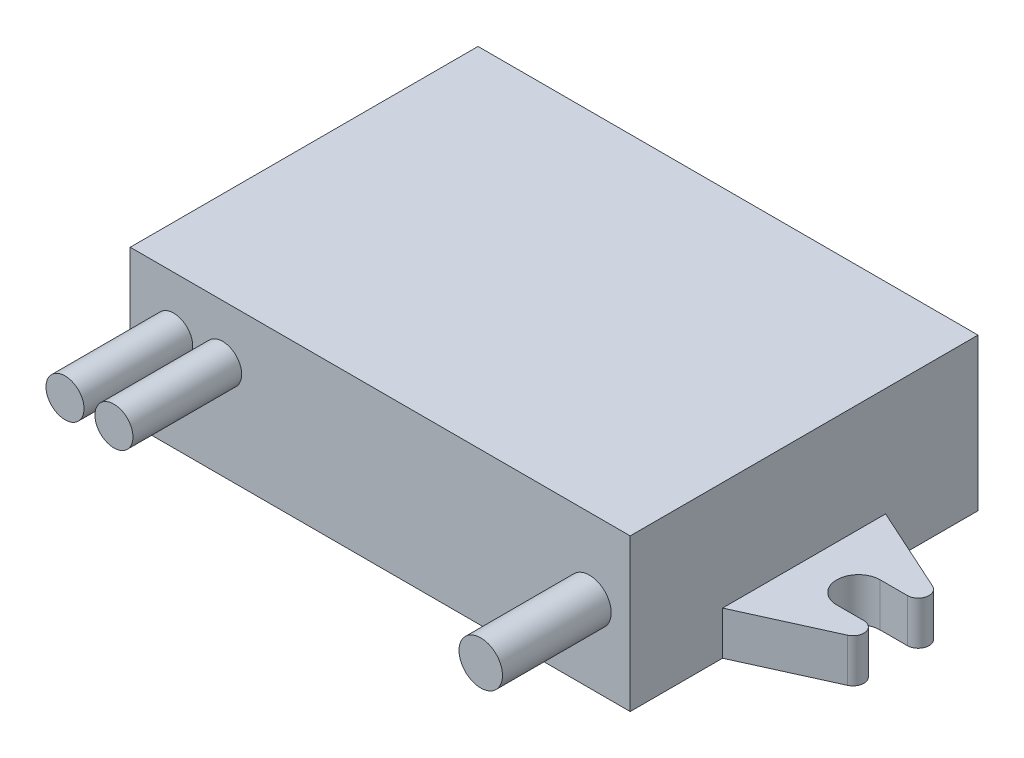
ISO-10303-21;
HEADER;
FILE_DESCRIPTION(('STEP AP214'),'2;1');
FILE_NAME('part.step','',(''),(''),'','','');
FILE_SCHEMA(('AUTOMOTIVE_DESIGN { 1 0 10303 214 1 1 1 1 }'));
ENDSEC;
DATA;
#1=APPLICATION_CONTEXT('core data for automotive mechanical design processes');
#2=APPLICATION_PROTOCOL_DEFINITION('international standard','automotive_design',2000,#1);
#3=PRODUCT_CONTEXT('',#1,'mechanical');
#4=PRODUCT('Part','Part','',(#3));
#5=PRODUCT_RELATED_PRODUCT_CATEGORY('part','',(#4));
#6=PRODUCT_DEFINITION_FORMATION('','',#4);
#7=PRODUCT_DEFINITION_CONTEXT('part definition',#1,'design');
#8=PRODUCT_DEFINITION('design','',#6,#7);
#9=PRODUCT_DEFINITION_SHAPE('','',#8);
#10=(LENGTH_UNIT() NAMED_UNIT(*) SI_UNIT(.MILLI.,.METRE.));
#11=(NAMED_UNIT(*) PLANE_ANGLE_UNIT() SI_UNIT($,.RADIAN.));
#12=(NAMED_UNIT(*) SI_UNIT($,.STERADIAN.) SOLID_ANGLE_UNIT());
#13=UNCERTAINTY_MEASURE_WITH_UNIT(LENGTH_MEASURE(1.E-05),#10,'distance_accuracy_value','');
#14=(GEOMETRIC_REPRESENTATION_CONTEXT(3) GLOBAL_UNCERTAINTY_ASSIGNED_CONTEXT((#13)) GLOBAL_UNIT_ASSIGNED_CONTEXT((#10,
#11,#12)) REPRESENTATION_CONTEXT('',''));
#15=CARTESIAN_POINT('',(0.,0.,0.));
#16=DIRECTION('',(0.,0.,1.));
#17=DIRECTION('',(1.,0.,0.));
#18=AXIS2_PLACEMENT_3D('',#15,#16,#17);
#19=CARTESIAN_POINT('',(23.,14.,16.));
#20=DIRECTION('',(-1.,0.,0.));
#21=DIRECTION('',(0.,0.,1.));
#22=AXIS2_PLACEMENT_3D('',#19,#20,#21);
#23=PLANE('',#22);
#24=DIRECTION('',(0.,-1.,0.));
#25=VECTOR('',#24,1.);
#26=CARTESIAN_POINT('',(23.,4.,7.5));
#27=LINE('',#26,#25);
#28=CARTESIAN_POINT('',(23.,4.,7.5));
#29=VERTEX_POINT('',#28);
#30=CARTESIAN_POINT('',(23.,0.,7.50000000000001));
#31=VERTEX_POINT('',#30);
#32=EDGE_CURVE('E217',#29,#31,#27,.T.);
#33=ORIENTED_EDGE('',*,*,#32,.F.);
#34=DIRECTION('',(0.,0.,-1.));
#35=VECTOR('',#34,1.);
#36=CARTESIAN_POINT('',(23.,4.,-7.5));
#37=LINE('',#36,#35);
#38=CARTESIAN_POINT('',(23.,4.,-7.5));
#39=VERTEX_POINT('',#38);
#40=EDGE_CURVE('E47',#29,#39,#37,.T.);
#41=ORIENTED_EDGE('',*,*,#40,.T.);
#42=DIRECTION('',(0.,-1.,0.));
#43=VECTOR('',#42,1.);
#44=CARTESIAN_POINT('',(23.,4.,-7.5));
#45=LINE('',#44,#43);
#46=CARTESIAN_POINT('',(23.,0.,-7.5));
#47=VERTEX_POINT('',#46);
#48=EDGE_CURVE('E179',#39,#47,#45,.T.);
#49=ORIENTED_EDGE('',*,*,#48,.T.);
#50=DIRECTION('',(0.,0.,-1.));
#51=VECTOR('',#50,1.);
#52=CARTESIAN_POINT('',(23.,0.,16.));
#53=LINE('',#52,#51);
#54=CARTESIAN_POINT('',(23.,0.,-16.));
#55=VERTEX_POINT('',#54);
#56=EDGE_CURVE('E307',#47,#55,#53,.T.);
#57=ORIENTED_EDGE('',*,*,#56,.T.);
#58=DIRECTION('',(0.,-1.,0.));
#59=VECTOR('',#58,1.);
#60=CARTESIAN_POINT('',(23.,14.,-16.));
#61=LINE('',#60,#59);
#62=CARTESIAN_POINT('',(23.,14.,-16.));
#63=VERTEX_POINT('',#62);
#64=EDGE_CURVE('E319',#63,#55,#61,.T.);
#65=ORIENTED_EDGE('',*,*,#64,.F.);
#66=DIRECTION('',(0.,0.,-1.));
#67=VECTOR('',#66,1.);
#68=CARTESIAN_POINT('',(23.,14.,16.));
#69=LINE('',#68,#67);
#70=CARTESIAN_POINT('',(23.,14.,16.));
#71=VERTEX_POINT('',#70);
#72=EDGE_CURVE('E295',#71,#63,#69,.T.);
#73=ORIENTED_EDGE('',*,*,#72,.F.);
#74=DIRECTION('',(0.,-1.,0.));
#75=VECTOR('',#74,1.);
#76=CARTESIAN_POINT('',(23.,14.,16.));
#77=LINE('',#76,#75);
#78=CARTESIAN_POINT('',(23.,0.,16.));
#79=VERTEX_POINT('',#78);
#80=EDGE_CURVE('E322',#71,#79,#77,.T.);
#81=ORIENTED_EDGE('',*,*,#80,.T.);
#82=EDGE_CURVE('E54',#79,#31,#53,.T.);
#83=ORIENTED_EDGE('',*,*,#82,.T.);
#84=EDGE_LOOP('',(#33,#41,#49,#57,#65,#73,#81,#83));
#85=FACE_BOUND('',#84,.T.);
#86=ADVANCED_FACE('F32',(#85),#23,.F.);
#87=CARTESIAN_POINT('',(-23.,14.,16.));
#88=DIRECTION('',(-1.,0.,0.));
#89=DIRECTION('',(0.,0.,1.));
#90=AXIS2_PLACEMENT_3D('',#87,#88,#89);
#91=PLANE('',#90);
#92=DIRECTION('',(0.,0.,-1.));
#93=VECTOR('',#92,1.);
#94=CARTESIAN_POINT('',(-23.,0.,16.));
#95=LINE('',#94,#93);
#96=CARTESIAN_POINT('',(-23.,0.,-7.5));
#97=VERTEX_POINT('',#96);
#98=CARTESIAN_POINT('',(-23.,0.,-16.));
#99=VERTEX_POINT('',#98);
#100=EDGE_CURVE('E312',#97,#99,#95,.T.);
#101=ORIENTED_EDGE('',*,*,#100,.F.);
#102=DIRECTION('',(0.,-1.,0.));
#103=VECTOR('',#102,1.);
#104=CARTESIAN_POINT('',(-23.,4.,-7.5));
#105=LINE('',#104,#103);
#106=CARTESIAN_POINT('',(-23.,4.,-7.5));
#107=VERTEX_POINT('',#106);
#108=EDGE_CURVE('E246',#107,#97,#105,.T.);
#109=ORIENTED_EDGE('',*,*,#108,.F.);
#110=DIRECTION('',(0.,0.,1.));
#111=VECTOR('',#110,1.);
#112=CARTESIAN_POINT('',(-23.,4.,7.5));
#113=LINE('',#112,#111);
#114=CARTESIAN_POINT('',(-23.,4.,7.5));
#115=VERTEX_POINT('',#114);
#116=EDGE_CURVE('E258',#107,#115,#113,.T.);
#117=ORIENTED_EDGE('',*,*,#116,.T.);
#118=DIRECTION('',(0.,-1.,0.));
#119=VECTOR('',#118,1.);
#120=CARTESIAN_POINT('',(-23.,4.,7.5));
#121=LINE('',#120,#119);
#122=CARTESIAN_POINT('',(-23.,0.,7.5));
#123=VERTEX_POINT('',#122);
#124=EDGE_CURVE('E273',#115,#123,#121,.T.);
#125=ORIENTED_EDGE('',*,*,#124,.T.);
#126=CARTESIAN_POINT('',(-23.,0.,16.));
#127=VERTEX_POINT('',#126);
#128=EDGE_CURVE('E296',#127,#123,#95,.T.);
#129=ORIENTED_EDGE('',*,*,#128,.F.);
#130=DIRECTION('',(0.,-1.,0.));
#131=VECTOR('',#130,1.);
#132=CARTESIAN_POINT('',(-23.,14.,16.));
#133=LINE('',#132,#131);
#134=CARTESIAN_POINT('',(-23.,14.,16.));
#135=VERTEX_POINT('',#134);
#136=EDGE_CURVE('E304',#135,#127,#133,.T.);
#137=ORIENTED_EDGE('',*,*,#136,.F.);
#138=DIRECTION('',(0.,0.,-1.));
#139=VECTOR('',#138,1.);
#140=CARTESIAN_POINT('',(-23.,14.,16.));
#141=LINE('',#140,#139);
#142=CARTESIAN_POINT('',(-23.,14.,-16.));
#143=VERTEX_POINT('',#142);
#144=EDGE_CURVE('E301',#135,#143,#141,.T.);
#145=ORIENTED_EDGE('',*,*,#144,.T.);
#146=DIRECTION('',(0.,-1.,0.));
#147=VECTOR('',#146,1.);
#148=CARTESIAN_POINT('',(-23.,14.,-16.));
#149=LINE('',#148,#147);
#150=EDGE_CURVE('E316',#143,#99,#149,.T.);
#151=ORIENTED_EDGE('',*,*,#150,.T.);
#152=EDGE_LOOP('',(#101,#109,#117,#125,#129,#137,#145,#151));
#153=FACE_BOUND('',#152,.T.);
#154=ADVANCED_FACE('F334',(#153),#91,.T.);
#155=CARTESIAN_POINT('',(-23.,14.,16.));
#156=DIRECTION('',(0.,0.,-1.));
#157=DIRECTION('',(-1.,0.,0.));
#158=AXIS2_PLACEMENT_3D('',#155,#156,#157);
#159=PLANE('',#158);
#160=CARTESIAN_POINT('',(19.25,7.,16.));
#161=DIRECTION('',(0.,0.,-1.));
#162=DIRECTION('',(-1.,0.,0.));
#163=AXIS2_PLACEMENT_3D('',#160,#161,#162);
#164=CIRCLE('',#163,2.);
#165=CARTESIAN_POINT('',(17.25,7.,16.));
#166=VERTEX_POINT('',#165);
#167=EDGE_CURVE('E11',#166,#166,#164,.F.);
#168=ORIENTED_EDGE('',*,*,#167,.F.);
#169=EDGE_LOOP('',(#168));
#170=FACE_BOUND('',#169,.T.);
#171=CARTESIAN_POINT('',(-14.5,9.,16.));
#172=DIRECTION('',(0.,0.,-1.));
#173=DIRECTION('',(-1.,0.,0.));
#174=AXIS2_PLACEMENT_3D('',#171,#172,#173);
#175=CIRCLE('',#174,1.75);
#176=CARTESIAN_POINT('',(-16.25,9.,16.));
#177=VERTEX_POINT('',#176);
#178=EDGE_CURVE('E40',#177,#177,#175,.F.);
#179=ORIENTED_EDGE('',*,*,#178,.F.);
#180=EDGE_LOOP('',(#179));
#181=FACE_BOUND('',#180,.T.);
#182=CARTESIAN_POINT('',(-19.,9.,16.));
#183=DIRECTION('',(0.,0.,-1.));
#184=DIRECTION('',(-1.,0.,0.));
#185=AXIS2_PLACEMENT_3D('',#182,#183,#184);
#186=CIRCLE('',#185,1.75);
#187=CARTESIAN_POINT('',(-20.75,9.,16.));
#188=VERTEX_POINT('',#187);
#189=EDGE_CURVE('E324',#188,#188,#186,.F.);
#190=ORIENTED_EDGE('',*,*,#189,.F.);
#191=EDGE_LOOP('',(#190));
#192=FACE_BOUND('',#191,.T.);
#193=DIRECTION('',(1.,0.,0.));
#194=VECTOR('',#193,1.);
#195=CARTESIAN_POINT('',(-23.,0.,16.));
#196=LINE('',#195,#194);
#197=EDGE_CURVE('E285',#127,#79,#196,.T.);
#198=ORIENTED_EDGE('',*,*,#197,.T.);
#199=ORIENTED_EDGE('',*,*,#80,.F.);
#200=DIRECTION('',(1.,0.,0.));
#201=VECTOR('',#200,1.);
#202=CARTESIAN_POINT('',(-23.,14.,16.));
#203=LINE('',#202,#201);
#204=EDGE_CURVE('E292',#135,#71,#203,.T.);
#205=ORIENTED_EDGE('',*,*,#204,.F.);
#206=ORIENTED_EDGE('',*,*,#136,.T.);
#207=EDGE_LOOP('',(#198,#199,#205,#206));
#208=FACE_BOUND('',#207,.T.);
#209=ADVANCED_FACE('F34',(#170,#181,#192,#208),#159,.F.);
#210=CARTESIAN_POINT('',(-23.,14.,-16.));
#211=DIRECTION('',(0.,0.,-1.));
#212=DIRECTION('',(-1.,0.,0.));
#213=AXIS2_PLACEMENT_3D('',#210,#211,#212);
#214=PLANE('',#213);
#215=DIRECTION('',(1.,0.,0.));
#216=VECTOR('',#215,1.);
#217=CARTESIAN_POINT('',(-23.,0.,-16.));
#218=LINE('',#217,#216);
#219=EDGE_CURVE('E309',#99,#55,#218,.T.);
#220=ORIENTED_EDGE('',*,*,#219,.F.);
#221=ORIENTED_EDGE('',*,*,#150,.F.);
#222=DIRECTION('',(1.,0.,0.));
#223=VECTOR('',#222,1.);
#224=CARTESIAN_POINT('',(-23.,14.,-16.));
#225=LINE('',#224,#223);
#226=EDGE_CURVE('E298',#143,#63,#225,.T.);
#227=ORIENTED_EDGE('',*,*,#226,.T.);
#228=ORIENTED_EDGE('',*,*,#64,.T.);
#229=EDGE_LOOP('',(#220,#221,#227,#228));
#230=FACE_BOUND('',#229,.T.);
#231=ADVANCED_FACE('F333',(#230),#214,.T.);
#232=CARTESIAN_POINT('',(0.,14.,0.));
#233=DIRECTION('',(0.,1.,0.));
#234=DIRECTION('',(0.,0.,1.));
#235=AXIS2_PLACEMENT_3D('',#232,#233,#234);
#236=PLANE('',#235);
#237=ORIENTED_EDGE('',*,*,#204,.T.);
#238=ORIENTED_EDGE('',*,*,#72,.T.);
#239=ORIENTED_EDGE('',*,*,#226,.F.);
#240=ORIENTED_EDGE('',*,*,#144,.F.);
#241=EDGE_LOOP('',(#237,#238,#239,#240));
#242=FACE_BOUND('',#241,.T.);
#243=ADVANCED_FACE('F407',(#242),#236,.T.);
#244=CARTESIAN_POINT('',(0.,0.,0.));
#245=DIRECTION('',(0.,1.,0.));
#246=DIRECTION('',(0.,0.,1.));
#247=AXIS2_PLACEMENT_3D('',#244,#245,#246);
#248=PLANE('',#247);
#249=DIRECTION('',(0.910693490048175,0.,-0.413082760695572));
#250=VECTOR('',#249,1.);
#251=CARTESIAN_POINT('',(30.9130827606956,0.,3.91069349004817));
#252=LINE('',#251,#250);
#253=CARTESIAN_POINT('',(30.9130827606956,0.,3.91069349004817));
#254=VERTEX_POINT('',#253);
#255=EDGE_CURVE('E190',#31,#254,#252,.T.);
#256=ORIENTED_EDGE('',*,*,#255,.F.);
#257=ORIENTED_EDGE('',*,*,#82,.F.);
#258=ORIENTED_EDGE('',*,*,#197,.F.);
#259=ORIENTED_EDGE('',*,*,#128,.T.);
#260=DIRECTION('',(-0.910693490048175,0.,-0.413082760695572));
#261=VECTOR('',#260,1.);
#262=CARTESIAN_POINT('',(-30.9130827606956,0.,3.91069349004817));
#263=LINE('',#262,#261);
#264=CARTESIAN_POINT('',(-30.9130827606956,0.,3.91069349004817));
#265=VERTEX_POINT('',#264);
#266=EDGE_CURVE('E249',#123,#265,#263,.T.);
#267=ORIENTED_EDGE('',*,*,#266,.T.);
#268=CARTESIAN_POINT('',(-30.5,0.,3.));
#269=DIRECTION('',(0.,-1.,0.));
#270=DIRECTION('',(0.,0.,1.));
#271=AXIS2_PLACEMENT_3D('',#268,#269,#270);
#272=CIRCLE('',#271,0.999999999999999);
#273=CARTESIAN_POINT('',(-30.5,0.,2.));
#274=VERTEX_POINT('',#273);
#275=EDGE_CURVE('E276',#265,#274,#272,.T.);
#276=ORIENTED_EDGE('',*,*,#275,.T.);
#277=DIRECTION('',(1.,0.,0.));
#278=VECTOR('',#277,1.);
#279=CARTESIAN_POINT('',(-28.,0.,2.));
#280=LINE('',#279,#278);
#281=CARTESIAN_POINT('',(-28.,0.,2.));
#282=VERTEX_POINT('',#281);
#283=EDGE_CURVE('E279',#274,#282,#280,.T.);
#284=ORIENTED_EDGE('',*,*,#283,.T.);
#285=CARTESIAN_POINT('',(-28.,0.,0.));
#286=DIRECTION('',(0.,1.,0.));
#287=DIRECTION('',(0.,0.,-1.));
#288=AXIS2_PLACEMENT_3D('',#285,#286,#287);
#289=CIRCLE('',#288,2.);
#290=CARTESIAN_POINT('',(-28.,0.,-2.));
#291=VERTEX_POINT('',#290);
#292=EDGE_CURVE('E262',#282,#291,#289,.T.);
#293=ORIENTED_EDGE('',*,*,#292,.T.);
#294=DIRECTION('',(1.,0.,0.));
#295=VECTOR('',#294,1.);
#296=CARTESIAN_POINT('',(-28.,0.,-2.));
#297=LINE('',#296,#295);
#298=CARTESIAN_POINT('',(-30.5,0.,-2.));
#299=VERTEX_POINT('',#298);
#300=EDGE_CURVE('E225',#299,#291,#297,.T.);
#301=ORIENTED_EDGE('',*,*,#300,.F.);
#302=CARTESIAN_POINT('',(-30.5,0.,-3.));
#303=DIRECTION('',(0.,1.,0.));
#304=DIRECTION('',(0.,0.,-1.));
#305=AXIS2_PLACEMENT_3D('',#302,#303,#304);
#306=CIRCLE('',#305,0.999999999999999);
#307=CARTESIAN_POINT('',(-30.9130827606956,0.,-3.91069349004817));
#308=VERTEX_POINT('',#307);
#309=EDGE_CURVE('E243',#308,#299,#306,.T.);
#310=ORIENTED_EDGE('',*,*,#309,.F.);
#311=DIRECTION('',(-0.910693490048175,0.,0.413082760695572));
#312=VECTOR('',#311,1.);
#313=CARTESIAN_POINT('',(-30.9130827606956,0.,-3.91069349004817));
#314=LINE('',#313,#312);
#315=EDGE_CURVE('E236',#97,#308,#314,.T.);
#316=ORIENTED_EDGE('',*,*,#315,.F.);
#317=ORIENTED_EDGE('',*,*,#100,.T.);
#318=ORIENTED_EDGE('',*,*,#219,.T.);
#319=ORIENTED_EDGE('',*,*,#56,.F.);
#320=DIRECTION('',(0.910693490048175,0.,0.413082760695572));
#321=VECTOR('',#320,1.);
#322=CARTESIAN_POINT('',(30.9130827606956,0.,-3.91069349004817));
#323=LINE('',#322,#321);
#324=CARTESIAN_POINT('',(30.9130827606956,0.,-3.91069349004817));
#325=VERTEX_POINT('',#324);
#326=EDGE_CURVE('E213',#47,#325,#323,.T.);
#327=ORIENTED_EDGE('',*,*,#326,.T.);
#328=CARTESIAN_POINT('',(30.5,0.,-3.));
#329=DIRECTION('',(0.,-1.,0.));
#330=DIRECTION('',(0.,0.,-1.));
#331=AXIS2_PLACEMENT_3D('',#328,#329,#330);
#332=CIRCLE('',#331,0.999999999999999);
#333=CARTESIAN_POINT('',(30.5,0.,-2.));
#334=VERTEX_POINT('',#333);
#335=EDGE_CURVE('E216',#325,#334,#332,.T.);
#336=ORIENTED_EDGE('',*,*,#335,.T.);
#337=DIRECTION('',(-1.,0.,0.));
#338=VECTOR('',#337,1.);
#339=CARTESIAN_POINT('',(28.,0.,-2.));
#340=LINE('',#339,#338);
#341=CARTESIAN_POINT('',(28.,0.,-2.));
#342=VERTEX_POINT('',#341);
#343=EDGE_CURVE('E220',#334,#342,#340,.T.);
#344=ORIENTED_EDGE('',*,*,#343,.T.);
#345=CARTESIAN_POINT('',(28.,0.,0.));
#346=DIRECTION('',(0.,1.,0.));
#347=DIRECTION('',(0.,0.,1.));
#348=AXIS2_PLACEMENT_3D('',#345,#346,#347);
#349=CIRCLE('',#348,2.);
#350=CARTESIAN_POINT('',(28.,0.,2.));
#351=VERTEX_POINT('',#350);
#352=EDGE_CURVE('E206',#342,#351,#349,.T.);
#353=ORIENTED_EDGE('',*,*,#352,.T.);
#354=DIRECTION('',(-1.,0.,0.));
#355=VECTOR('',#354,1.);
#356=CARTESIAN_POINT('',(28.,0.,2.));
#357=LINE('',#356,#355);
#358=CARTESIAN_POINT('',(30.5,0.,2.));
#359=VERTEX_POINT('',#358);
#360=EDGE_CURVE('E195',#359,#351,#357,.T.);
#361=ORIENTED_EDGE('',*,*,#360,.F.);
#362=CARTESIAN_POINT('',(30.5,0.,3.));
#363=DIRECTION('',(0.,1.,0.));
#364=DIRECTION('',(0.,0.,1.));
#365=AXIS2_PLACEMENT_3D('',#362,#363,#364);
#366=CIRCLE('',#365,0.999999999999999);
#367=EDGE_CURVE('E486',#254,#359,#366,.T.);
#368=ORIENTED_EDGE('',*,*,#367,.F.);
#369=EDGE_LOOP('',(#256,#257,#258,#259,#267,#276,#284,#293,#301,#310,#316,#317,#318,#319,#327,
#336,#344,#353,#361,#368));
#370=FACE_BOUND('',#369,.T.);
#371=ADVANCED_FACE('F344',(#370),#248,.F.);
#372=CARTESIAN_POINT('',(-28.,4.,0.));
#373=DIRECTION('',(0.,-1.,0.));
#374=DIRECTION('',(0.,0.,-1.));
#375=AXIS2_PLACEMENT_3D('',#372,#373,#374);
#376=CYLINDRICAL_SURFACE('',#375,2.);
#377=ORIENTED_EDGE('',*,*,#292,.F.);
#378=DIRECTION('',(0.,-1.,0.));
#379=VECTOR('',#378,1.);
#380=CARTESIAN_POINT('',(-28.,4.,2.));
#381=LINE('',#380,#379);
#382=CARTESIAN_POINT('',(-28.,4.,2.));
#383=VERTEX_POINT('',#382);
#384=EDGE_CURVE('E283',#383,#282,#381,.T.);
#385=ORIENTED_EDGE('',*,*,#384,.F.);
#386=CARTESIAN_POINT('',(-28.,4.,0.));
#387=DIRECTION('',(0.,1.,0.));
#388=DIRECTION('',(0.,0.,-1.));
#389=AXIS2_PLACEMENT_3D('',#386,#387,#388);
#390=CIRCLE('',#389,2.);
#391=CARTESIAN_POINT('',(-28.,4.,-2.));
#392=VERTEX_POINT('',#391);
#393=EDGE_CURVE('E271',#383,#392,#390,.T.);
#394=ORIENTED_EDGE('',*,*,#393,.T.);
#395=DIRECTION('',(0.,-1.,0.));
#396=VECTOR('',#395,1.);
#397=CARTESIAN_POINT('',(-28.,4.,-2.));
#398=LINE('',#397,#396);
#399=EDGE_CURVE('E240',#392,#291,#398,.T.);
#400=ORIENTED_EDGE('',*,*,#399,.T.);
#401=EDGE_LOOP('',(#377,#385,#394,#400));
#402=FACE_BOUND('',#401,.T.);
#403=ADVANCED_FACE('F363',(#402),#376,.F.);
#404=CARTESIAN_POINT('',(-28.,4.,2.));
#405=DIRECTION('',(0.,0.,-1.));
#406=DIRECTION('',(-1.,0.,0.));
#407=AXIS2_PLACEMENT_3D('',#404,#405,#406);
#408=PLANE('',#407);
#409=ORIENTED_EDGE('',*,*,#283,.F.);
#410=DIRECTION('',(0.,-1.,0.));
#411=VECTOR('',#410,1.);
#412=CARTESIAN_POINT('',(-30.5,4.,2.));
#413=LINE('',#412,#411);
#414=CARTESIAN_POINT('',(-30.5,4.,2.));
#415=VERTEX_POINT('',#414);
#416=EDGE_CURVE('E286',#415,#274,#413,.T.);
#417=ORIENTED_EDGE('',*,*,#416,.F.);
#418=DIRECTION('',(1.,0.,0.));
#419=VECTOR('',#418,1.);
#420=CARTESIAN_POINT('',(-28.,4.,2.));
#421=LINE('',#420,#419);
#422=EDGE_CURVE('E268',#415,#383,#421,.T.);
#423=ORIENTED_EDGE('',*,*,#422,.T.);
#424=ORIENTED_EDGE('',*,*,#384,.T.);
#425=EDGE_LOOP('',(#409,#417,#423,#424));
#426=FACE_BOUND('',#425,.T.);
#427=ADVANCED_FACE('F418',(#426),#408,.T.);
#428=CARTESIAN_POINT('',(-30.5,4.,3.));
#429=DIRECTION('',(0.,-1.,0.));
#430=DIRECTION('',(0.,0.,-1.));
#431=AXIS2_PLACEMENT_3D('',#428,#429,#430);
#432=CYLINDRICAL_SURFACE('',#431,0.999999999999999);
#433=ORIENTED_EDGE('',*,*,#275,.F.);
#434=DIRECTION('',(0.,-1.,0.));
#435=VECTOR('',#434,1.);
#436=CARTESIAN_POINT('',(-30.9130827606956,4.,3.91069349004817));
#437=LINE('',#436,#435);
#438=CARTESIAN_POINT('',(-30.9130827606956,4.,3.91069349004817));
#439=VERTEX_POINT('',#438);
#440=EDGE_CURVE('E288',#439,#265,#437,.T.);
#441=ORIENTED_EDGE('',*,*,#440,.F.);
#442=CARTESIAN_POINT('',(-30.5,4.,3.));
#443=DIRECTION('',(0.,-1.,0.));
#444=DIRECTION('',(0.,0.,1.));
#445=AXIS2_PLACEMENT_3D('',#442,#443,#444);
#446=CIRCLE('',#445,0.999999999999999);
#447=EDGE_CURVE('E265',#439,#415,#446,.T.);
#448=ORIENTED_EDGE('',*,*,#447,.T.);
#449=ORIENTED_EDGE('',*,*,#416,.T.);
#450=EDGE_LOOP('',(#433,#441,#448,#449));
#451=FACE_BOUND('',#450,.T.);
#452=ADVANCED_FACE('F357',(#451),#432,.T.);
#453=CARTESIAN_POINT('',(-30.9130827606956,4.,3.91069349004817));
#454=DIRECTION('',(-0.413082760695572,0.,0.910693490048175));
#455=DIRECTION('',(0.910693490048175,0.,0.413082760695572));
#456=AXIS2_PLACEMENT_3D('',#453,#454,#455);
#457=PLANE('',#456);
#458=ORIENTED_EDGE('',*,*,#266,.F.);
#459=ORIENTED_EDGE('',*,*,#124,.F.);
#460=DIRECTION('',(-0.910693490048175,0.,-0.413082760695572));
#461=VECTOR('',#460,1.);
#462=CARTESIAN_POINT('',(-30.9130827606956,4.,3.91069349004817));
#463=LINE('',#462,#461);
#464=EDGE_CURVE('E261',#115,#439,#463,.T.);
#465=ORIENTED_EDGE('',*,*,#464,.T.);
#466=ORIENTED_EDGE('',*,*,#440,.T.);
#467=EDGE_LOOP('',(#458,#459,#465,#466));
#468=FACE_BOUND('',#467,.T.);
#469=ADVANCED_FACE('F349',(#468),#457,.T.);
#470=CARTESIAN_POINT('',(-28.,4.,0.));
#471=DIRECTION('',(0.,-1.,0.));
#472=DIRECTION('',(0.,0.,-1.));
#473=AXIS2_PLACEMENT_3D('',#470,#471,#472);
#474=PLANE('',#473);
#475=ORIENTED_EDGE('',*,*,#116,.F.);
#476=DIRECTION('',(-0.910693490048175,0.,0.413082760695572));
#477=VECTOR('',#476,1.);
#478=CARTESIAN_POINT('',(-30.9130827606956,4.,-3.91069349004817));
#479=LINE('',#478,#477);
#480=CARTESIAN_POINT('',(-30.9130827606956,4.,-3.91069349004817));
#481=VERTEX_POINT('',#480);
#482=EDGE_CURVE('E238',#107,#481,#479,.T.);
#483=ORIENTED_EDGE('',*,*,#482,.T.);
#484=CARTESIAN_POINT('',(-30.5,4.,-3.));
#485=DIRECTION('',(0.,1.,0.));
#486=DIRECTION('',(0.,0.,-1.));
#487=AXIS2_PLACEMENT_3D('',#484,#485,#486);
#488=CIRCLE('',#487,0.999999999999999);
#489=CARTESIAN_POINT('',(-30.5,4.,-2.));
#490=VERTEX_POINT('',#489);
#491=EDGE_CURVE('E235',#481,#490,#488,.T.);
#492=ORIENTED_EDGE('',*,*,#491,.T.);
#493=DIRECTION('',(1.,0.,0.));
#494=VECTOR('',#493,1.);
#495=CARTESIAN_POINT('',(-28.,4.,-2.));
#496=LINE('',#495,#494);
#497=EDGE_CURVE('E232',#490,#392,#496,.T.);
#498=ORIENTED_EDGE('',*,*,#497,.T.);
#499=ORIENTED_EDGE('',*,*,#393,.F.);
#500=ORIENTED_EDGE('',*,*,#422,.F.);
#501=ORIENTED_EDGE('',*,*,#447,.F.);
#502=ORIENTED_EDGE('',*,*,#464,.F.);
#503=EDGE_LOOP('',(#475,#483,#492,#498,#499,#500,#501,#502));
#504=FACE_BOUND('',#503,.T.);
#505=ADVANCED_FACE('F352',(#504),#474,.F.);
#506=CARTESIAN_POINT('',(-30.9130827606956,4.,-3.91069349004817));
#507=DIRECTION('',(0.413082760695572,0.,0.910693490048175));
#508=DIRECTION('',(0.910693490048175,0.,-0.413082760695572));
#509=AXIS2_PLACEMENT_3D('',#506,#507,#508);
#510=PLANE('',#509);
#511=ORIENTED_EDGE('',*,*,#315,.T.);
#512=DIRECTION('',(0.,-1.,0.));
#513=VECTOR('',#512,1.);
#514=CARTESIAN_POINT('',(-30.9130827606956,4.,-3.91069349004817));
#515=LINE('',#514,#513);
#516=EDGE_CURVE('E250',#481,#308,#515,.T.);
#517=ORIENTED_EDGE('',*,*,#516,.F.);
#518=ORIENTED_EDGE('',*,*,#482,.F.);
#519=ORIENTED_EDGE('',*,*,#108,.T.);
#520=EDGE_LOOP('',(#511,#517,#518,#519));
#521=FACE_BOUND('',#520,.T.);
#522=ADVANCED_FACE('F377',(#521),#510,.F.);
#523=CARTESIAN_POINT('',(-30.5,4.,-3.));
#524=DIRECTION('',(0.,-1.,0.));
#525=DIRECTION('',(0.,0.,-1.));
#526=AXIS2_PLACEMENT_3D('',#523,#524,#525);
#527=CYLINDRICAL_SURFACE('',#526,0.999999999999999);
#528=ORIENTED_EDGE('',*,*,#309,.T.);
#529=DIRECTION('',(0.,-1.,0.));
#530=VECTOR('',#529,1.);
#531=CARTESIAN_POINT('',(-30.5,4.,-2.));
#532=LINE('',#531,#530);
#533=EDGE_CURVE('E253',#490,#299,#532,.T.);
#534=ORIENTED_EDGE('',*,*,#533,.F.);
#535=ORIENTED_EDGE('',*,*,#491,.F.);
#536=ORIENTED_EDGE('',*,*,#516,.T.);
#537=EDGE_LOOP('',(#528,#534,#535,#536));
#538=FACE_BOUND('',#537,.T.);
#539=ADVANCED_FACE('F372',(#538),#527,.T.);
#540=CARTESIAN_POINT('',(-28.,4.,-2.));
#541=DIRECTION('',(0.,0.,-1.));
#542=DIRECTION('',(-1.,0.,0.));
#543=AXIS2_PLACEMENT_3D('',#540,#541,#542);
#544=PLANE('',#543);
#545=ORIENTED_EDGE('',*,*,#300,.T.);
#546=ORIENTED_EDGE('',*,*,#399,.F.);
#547=ORIENTED_EDGE('',*,*,#497,.F.);
#548=ORIENTED_EDGE('',*,*,#533,.T.);
#549=EDGE_LOOP('',(#545,#546,#547,#548));
#550=FACE_BOUND('',#549,.T.);
#551=ADVANCED_FACE('F367',(#550),#544,.F.);
#552=CARTESIAN_POINT('',(28.,4.,0.));
#553=DIRECTION('',(0.,-1.,0.));
#554=DIRECTION('',(0.,0.,-1.));
#555=AXIS2_PLACEMENT_3D('',#552,#553,#554);
#556=CYLINDRICAL_SURFACE('',#555,2.);
#557=ORIENTED_EDGE('',*,*,#352,.F.);
#558=DIRECTION('',(0.,-1.,0.));
#559=VECTOR('',#558,1.);
#560=CARTESIAN_POINT('',(28.,4.,-2.));
#561=LINE('',#560,#559);
#562=CARTESIAN_POINT('',(28.,4.,-2.));
#563=VERTEX_POINT('',#562);
#564=EDGE_CURVE('E176',#563,#342,#561,.T.);
#565=ORIENTED_EDGE('',*,*,#564,.F.);
#566=CARTESIAN_POINT('',(28.,4.,0.));
#567=DIRECTION('',(0.,1.,0.));
#568=DIRECTION('',(0.,0.,1.));
#569=AXIS2_PLACEMENT_3D('',#566,#567,#568);
#570=CIRCLE('',#569,2.);
#571=CARTESIAN_POINT('',(28.,4.,2.));
#572=VERTEX_POINT('',#571);
#573=EDGE_CURVE('E170',#563,#572,#570,.T.);
#574=ORIENTED_EDGE('',*,*,#573,.T.);
#575=DIRECTION('',(0.,-1.,0.));
#576=VECTOR('',#575,1.);
#577=CARTESIAN_POINT('',(28.,4.,2.));
#578=LINE('',#577,#576);
#579=EDGE_CURVE('E175',#572,#351,#578,.T.);
#580=ORIENTED_EDGE('',*,*,#579,.T.);
#581=EDGE_LOOP('',(#557,#565,#574,#580));
#582=FACE_BOUND('',#581,.T.);
#583=ADVANCED_FACE('F173',(#582),#556,.F.);
#584=CARTESIAN_POINT('',(28.,4.,-2.));
#585=DIRECTION('',(0.,0.,1.));
#586=DIRECTION('',(1.,0.,0.));
#587=AXIS2_PLACEMENT_3D('',#584,#585,#586);
#588=PLANE('',#587);
#589=ORIENTED_EDGE('',*,*,#343,.F.);
#590=DIRECTION('',(0.,-1.,0.));
#591=VECTOR('',#590,1.);
#592=CARTESIAN_POINT('',(30.5,4.,-2.));
#593=LINE('',#592,#591);
#594=CARTESIAN_POINT('',(30.5,4.,-2.));
#595=VERTEX_POINT('',#594);
#596=EDGE_CURVE('E226',#595,#334,#593,.T.);
#597=ORIENTED_EDGE('',*,*,#596,.F.);
#598=DIRECTION('',(-1.,0.,0.));
#599=VECTOR('',#598,1.);
#600=CARTESIAN_POINT('',(28.,4.,-2.));
#601=LINE('',#600,#599);
#602=EDGE_CURVE('E180',#595,#563,#601,.T.);
#603=ORIENTED_EDGE('',*,*,#602,.T.);
#604=ORIENTED_EDGE('',*,*,#564,.T.);
#605=EDGE_LOOP('',(#589,#597,#603,#604));
#606=FACE_BOUND('',#605,.T.);
#607=ADVANCED_FACE('F391',(#606),#588,.T.);
#608=CARTESIAN_POINT('',(30.5,4.,-3.));
#609=DIRECTION('',(0.,-1.,0.));
#610=DIRECTION('',(0.,0.,-1.));
#611=AXIS2_PLACEMENT_3D('',#608,#609,#610);
#612=CYLINDRICAL_SURFACE('',#611,0.999999999999999);
#613=ORIENTED_EDGE('',*,*,#335,.F.);
#614=DIRECTION('',(0.,-1.,0.));
#615=VECTOR('',#614,1.);
#616=CARTESIAN_POINT('',(30.9130827606956,4.,-3.91069349004817));
#617=LINE('',#616,#615);
#618=CARTESIAN_POINT('',(30.9130827606956,4.,-3.91069349004817));
#619=VERTEX_POINT('',#618);
#620=EDGE_CURVE('E228',#619,#325,#617,.T.);
#621=ORIENTED_EDGE('',*,*,#620,.F.);
#622=CARTESIAN_POINT('',(30.5,4.,-3.));
#623=DIRECTION('',(0.,-1.,0.));
#624=DIRECTION('',(0.,0.,-1.));
#625=AXIS2_PLACEMENT_3D('',#622,#623,#624);
#626=CIRCLE('',#625,0.999999999999999);
#627=EDGE_CURVE('E209',#619,#595,#626,.T.);
#628=ORIENTED_EDGE('',*,*,#627,.T.);
#629=ORIENTED_EDGE('',*,*,#596,.T.);
#630=EDGE_LOOP('',(#613,#621,#628,#629));
#631=FACE_BOUND('',#630,.T.);
#632=ADVANCED_FACE('F388',(#631),#612,.T.);
#633=CARTESIAN_POINT('',(30.9130827606956,4.,-3.91069349004817));
#634=DIRECTION('',(0.413082760695572,0.,-0.910693490048175));
#635=DIRECTION('',(-0.910693490048175,0.,-0.413082760695572));
#636=AXIS2_PLACEMENT_3D('',#633,#634,#635);
#637=PLANE('',#636);
#638=ORIENTED_EDGE('',*,*,#326,.F.);
#639=ORIENTED_EDGE('',*,*,#48,.F.);
#640=DIRECTION('',(0.910693490048175,0.,0.413082760695572));
#641=VECTOR('',#640,1.);
#642=CARTESIAN_POINT('',(30.9130827606956,4.,-3.91069349004817));
#643=LINE('',#642,#641);
#644=EDGE_CURVE('E205',#39,#619,#643,.T.);
#645=ORIENTED_EDGE('',*,*,#644,.T.);
#646=ORIENTED_EDGE('',*,*,#620,.T.);
#647=EDGE_LOOP('',(#638,#639,#645,#646));
#648=FACE_BOUND('',#647,.T.);
#649=ADVANCED_FACE('F384',(#648),#637,.T.);
#650=CARTESIAN_POINT('',(28.,4.,0.));
#651=DIRECTION('',(0.,-1.,0.));
#652=DIRECTION('',(0.,0.,1.));
#653=AXIS2_PLACEMENT_3D('',#650,#651,#652);
#654=PLANE('',#653);
#655=ORIENTED_EDGE('',*,*,#40,.F.);
#656=DIRECTION('',(0.910693490048175,0.,-0.413082760695572));
#657=VECTOR('',#656,1.);
#658=CARTESIAN_POINT('',(30.9130827606956,4.,3.91069349004817));
#659=LINE('',#658,#657);
#660=CARTESIAN_POINT('',(30.9130827606956,4.,3.91069349004817));
#661=VERTEX_POINT('',#660);
#662=EDGE_CURVE('E197',#29,#661,#659,.T.);
#663=ORIENTED_EDGE('',*,*,#662,.T.);
#664=CARTESIAN_POINT('',(30.5,4.,3.));
#665=DIRECTION('',(0.,1.,0.));
#666=DIRECTION('',(0.,0.,1.));
#667=AXIS2_PLACEMENT_3D('',#664,#665,#666);
#668=CIRCLE('',#667,0.999999999999999);
#669=CARTESIAN_POINT('',(30.5,4.,2.));
#670=VERTEX_POINT('',#669);
#671=EDGE_CURVE('E186',#661,#670,#668,.T.);
#672=ORIENTED_EDGE('',*,*,#671,.T.);
#673=DIRECTION('',(-1.,0.,0.));
#674=VECTOR('',#673,1.);
#675=CARTESIAN_POINT('',(28.,4.,2.));
#676=LINE('',#675,#674);
#677=EDGE_CURVE('E183',#670,#572,#676,.T.);
#678=ORIENTED_EDGE('',*,*,#677,.T.);
#679=ORIENTED_EDGE('',*,*,#573,.F.);
#680=ORIENTED_EDGE('',*,*,#602,.F.);
#681=ORIENTED_EDGE('',*,*,#627,.F.);
#682=ORIENTED_EDGE('',*,*,#644,.F.);
#683=EDGE_LOOP('',(#655,#663,#672,#678,#679,#680,#681,#682));
#684=FACE_BOUND('',#683,.T.);
#685=ADVANCED_FACE('F184',(#684),#654,.F.);
#686=CARTESIAN_POINT('',(30.9130827606956,4.,3.91069349004817));
#687=DIRECTION('',(-0.413082760695572,0.,-0.910693490048175));
#688=DIRECTION('',(-0.910693490048175,0.,0.413082760695572));
#689=AXIS2_PLACEMENT_3D('',#686,#687,#688);
#690=PLANE('',#689);
#691=ORIENTED_EDGE('',*,*,#255,.T.);
#692=DIRECTION('',(0.,-1.,0.));
#693=VECTOR('',#692,1.);
#694=CARTESIAN_POINT('',(30.9130827606956,4.,3.91069349004817));
#695=LINE('',#694,#693);
#696=EDGE_CURVE('E199',#661,#254,#695,.T.);
#697=ORIENTED_EDGE('',*,*,#696,.F.);
#698=ORIENTED_EDGE('',*,*,#662,.F.);
#699=ORIENTED_EDGE('',*,*,#32,.T.);
#700=EDGE_LOOP('',(#691,#697,#698,#699));
#701=FACE_BOUND('',#700,.T.);
#702=ADVANCED_FACE('F435',(#701),#690,.F.);
#703=CARTESIAN_POINT('',(30.5,4.,3.));
#704=DIRECTION('',(0.,-1.,0.));
#705=DIRECTION('',(0.,0.,-1.));
#706=AXIS2_PLACEMENT_3D('',#703,#704,#705);
#707=CYLINDRICAL_SURFACE('',#706,0.999999999999999);
#708=ORIENTED_EDGE('',*,*,#367,.T.);
#709=DIRECTION('',(0.,-1.,0.));
#710=VECTOR('',#709,1.);
#711=CARTESIAN_POINT('',(30.5,4.,2.));
#712=LINE('',#711,#710);
#713=EDGE_CURVE('E196',#670,#359,#712,.T.);
#714=ORIENTED_EDGE('',*,*,#713,.F.);
#715=ORIENTED_EDGE('',*,*,#671,.F.);
#716=ORIENTED_EDGE('',*,*,#696,.T.);
#717=EDGE_LOOP('',(#708,#714,#715,#716));
#718=FACE_BOUND('',#717,.T.);
#719=ADVANCED_FACE('F440',(#718),#707,.T.);
#720=CARTESIAN_POINT('',(28.,4.,2.));
#721=DIRECTION('',(0.,0.,1.));
#722=DIRECTION('',(1.,0.,0.));
#723=AXIS2_PLACEMENT_3D('',#720,#721,#722);
#724=PLANE('',#723);
#725=ORIENTED_EDGE('',*,*,#360,.T.);
#726=ORIENTED_EDGE('',*,*,#579,.F.);
#727=ORIENTED_EDGE('',*,*,#677,.F.);
#728=ORIENTED_EDGE('',*,*,#713,.T.);
#729=EDGE_LOOP('',(#725,#726,#727,#728));
#730=FACE_BOUND('',#729,.T.);
#731=ADVANCED_FACE('F193',(#730),#724,.F.);
#732=CARTESIAN_POINT('',(-19.,9.,26.));
#733=DIRECTION('',(0.,0.,-1.));
#734=DIRECTION('',(-1.,0.,0.));
#735=AXIS2_PLACEMENT_3D('',#732,#733,#734);
#736=CYLINDRICAL_SURFACE('',#735,1.75);
#737=CARTESIAN_POINT('',(-19.,9.,26.));
#738=DIRECTION('',(0.,0.,1.));
#739=DIRECTION('',(1.,0.,0.));
#740=AXIS2_PLACEMENT_3D('',#737,#738,#739);
#741=CIRCLE('',#740,1.75);
#742=CARTESIAN_POINT('',(-17.25,9.,26.));
#743=VERTEX_POINT('',#742);
#744=EDGE_CURVE('E479',#743,#743,#741,.T.);
#745=ORIENTED_EDGE('',*,*,#744,.F.);
#746=EDGE_LOOP('',(#745));
#747=FACE_BOUND('',#746,.T.);
#748=ORIENTED_EDGE('',*,*,#189,.T.);
#749=EDGE_LOOP('',(#748));
#750=FACE_BOUND('',#749,.T.);
#751=ADVANCED_FACE('F446',(#747,#750),#736,.T.);
#752=CARTESIAN_POINT('',(-19.,9.,26.));
#753=DIRECTION('',(0.,0.,1.));
#754=DIRECTION('',(1.,0.,0.));
#755=AXIS2_PLACEMENT_3D('',#752,#753,#754);
#756=PLANE('',#755);
#757=ORIENTED_EDGE('',*,*,#744,.T.);
#758=EDGE_LOOP('',(#757));
#759=FACE_BOUND('',#758,.T.);
#760=ADVANCED_FACE('F452',(#759),#756,.T.);
#761=CARTESIAN_POINT('',(-14.5,9.,26.));
#762=DIRECTION('',(0.,0.,-1.));
#763=DIRECTION('',(-1.,0.,0.));
#764=AXIS2_PLACEMENT_3D('',#761,#762,#763);
#765=CYLINDRICAL_SURFACE('',#764,1.75);
#766=CARTESIAN_POINT('',(-14.5,9.,26.));
#767=DIRECTION('',(0.,0.,1.));
#768=DIRECTION('',(1.,0.,0.));
#769=AXIS2_PLACEMENT_3D('',#766,#767,#768);
#770=CIRCLE('',#769,1.75);
#771=CARTESIAN_POINT('',(-12.75,9.,26.));
#772=VERTEX_POINT('',#771);
#773=EDGE_CURVE('E476',#772,#772,#770,.T.);
#774=ORIENTED_EDGE('',*,*,#773,.F.);
#775=EDGE_LOOP('',(#774));
#776=FACE_BOUND('',#775,.T.);
#777=ORIENTED_EDGE('',*,*,#178,.T.);
#778=EDGE_LOOP('',(#777));
#779=FACE_BOUND('',#778,.T.);
#780=ADVANCED_FACE('F329',(#776,#779),#765,.T.);
#781=CARTESIAN_POINT('',(-14.5,9.,26.));
#782=DIRECTION('',(0.,0.,1.));
#783=DIRECTION('',(1.,0.,0.));
#784=AXIS2_PLACEMENT_3D('',#781,#782,#783);
#785=PLANE('',#784);
#786=ORIENTED_EDGE('',*,*,#773,.T.);
#787=EDGE_LOOP('',(#786));
#788=FACE_BOUND('',#787,.T.);
#789=ADVANCED_FACE('F459',(#788),#785,.T.);
#790=CARTESIAN_POINT('',(19.25,7.,26.));
#791=DIRECTION('',(0.,0.,-1.));
#792=DIRECTION('',(-1.,0.,0.));
#793=AXIS2_PLACEMENT_3D('',#790,#791,#792);
#794=CYLINDRICAL_SURFACE('',#793,2.);
#795=CARTESIAN_POINT('',(19.25,7.,26.));
#796=DIRECTION('',(0.,0.,1.));
#797=DIRECTION('',(1.,0.,0.));
#798=AXIS2_PLACEMENT_3D('',#795,#796,#797);
#799=CIRCLE('',#798,2.);
#800=CARTESIAN_POINT('',(21.25,7.,26.));
#801=VERTEX_POINT('',#800);
#802=EDGE_CURVE('E475',#801,#801,#799,.T.);
#803=ORIENTED_EDGE('',*,*,#802,.F.);
#804=EDGE_LOOP('',(#803));
#805=FACE_BOUND('',#804,.T.);
#806=ORIENTED_EDGE('',*,*,#167,.T.);
#807=EDGE_LOOP('',(#806));
#808=FACE_BOUND('',#807,.T.);
#809=ADVANCED_FACE('F463',(#805,#808),#794,.T.);
#810=CARTESIAN_POINT('',(19.25,7.,26.));
#811=DIRECTION('',(0.,0.,1.));
#812=DIRECTION('',(1.,0.,0.));
#813=AXIS2_PLACEMENT_3D('',#810,#811,#812);
#814=PLANE('',#813);
#815=ORIENTED_EDGE('',*,*,#802,.T.);
#816=EDGE_LOOP('',(#815));
#817=FACE_BOUND('',#816,.T.);
#818=ADVANCED_FACE('F467',(#817),#814,.T.);
#819=CLOSED_SHELL('',(#86,#154,#209,#231,#243,#371,#403,#427,#452,#469,#505,#522,#539,#551,#583,
#607,#632,#649,#685,#702,#719,#731,#751,#760,#780,#789,#809,#818));
#820=MANIFOLD_SOLID_BREP('B2',#819);
#821=ADVANCED_BREP_SHAPE_REPRESENTATION('',(#18,#820),#14);
#822=SHAPE_DEFINITION_REPRESENTATION(#9,#821);
ENDSEC;
END-ISO-10303-21;
